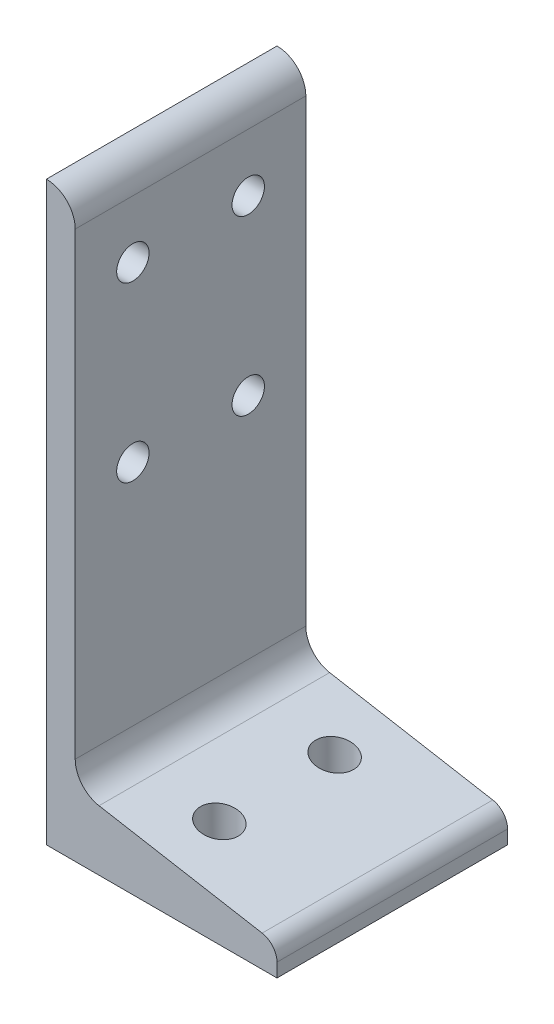
ISO-10303-21;
HEADER;
FILE_DESCRIPTION(('STEP AP214'),'2;1');
FILE_NAME('part.step','',(''),(''),'','','');
FILE_SCHEMA(('AUTOMOTIVE_DESIGN { 1 0 10303 214 1 1 1 1 }'));
ENDSEC;
DATA;
#1=APPLICATION_CONTEXT('core data for automotive mechanical design processes');
#2=APPLICATION_PROTOCOL_DEFINITION('international standard','automotive_design',2000,#1);
#3=PRODUCT_CONTEXT('',#1,'mechanical');
#4=PRODUCT('Part','Part','',(#3));
#5=PRODUCT_RELATED_PRODUCT_CATEGORY('part','',(#4));
#6=PRODUCT_DEFINITION_FORMATION('','',#4);
#7=PRODUCT_DEFINITION_CONTEXT('part definition',#1,'design');
#8=PRODUCT_DEFINITION('design','',#6,#7);
#9=PRODUCT_DEFINITION_SHAPE('','',#8);
#10=(LENGTH_UNIT() NAMED_UNIT(*) SI_UNIT(.MILLI.,.METRE.));
#11=(NAMED_UNIT(*) PLANE_ANGLE_UNIT() SI_UNIT($,.RADIAN.));
#12=(NAMED_UNIT(*) SI_UNIT($,.STERADIAN.) SOLID_ANGLE_UNIT());
#13=UNCERTAINTY_MEASURE_WITH_UNIT(LENGTH_MEASURE(1.E-05),#10,'distance_accuracy_value','');
#14=(GEOMETRIC_REPRESENTATION_CONTEXT(3) GLOBAL_UNCERTAINTY_ASSIGNED_CONTEXT((#13)) GLOBAL_UNIT_ASSIGNED_CONTEXT((#10,
#11,#12)) REPRESENTATION_CONTEXT('',''));
#15=CARTESIAN_POINT('',(0.,0.,0.));
#16=DIRECTION('',(0.,0.,1.));
#17=DIRECTION('',(1.,0.,0.));
#18=AXIS2_PLACEMENT_3D('',#15,#16,#17);
#19=CARTESIAN_POINT('',(-16.3878975119817,-59.0727168406568,50.8));
#20=DIRECTION('',(-1.,0.,0.));
#21=DIRECTION('',(0.,-1.,0.));
#22=AXIS2_PLACEMENT_3D('',#19,#20,#21);
#23=PLANE('',#22);
#24=CARTESIAN_POINT('',(-16.3878975119818,121.648995440178,12.6852380775335));
#25=DIRECTION('',(1.,0.,0.));
#26=DIRECTION('',(0.,1.,0.));
#27=AXIS2_PLACEMENT_3D('',#24,#25,#26);
#28=CIRCLE('',#27,3.56870000000001);
#29=CARTESIAN_POINT('',(-16.3878975119818,125.217695440178,12.6852380775335));
#30=VERTEX_POINT('',#29);
#31=EDGE_CURVE('E173',#30,#30,#28,.T.);
#32=ORIENTED_EDGE('',*,*,#31,.F.);
#33=EDGE_LOOP('',(#32));
#34=FACE_BOUND('',#33,.T.);
#35=CARTESIAN_POINT('',(-16.3878975119817,83.5489782815445,12.6852380775335));
#36=DIRECTION('',(1.,0.,0.));
#37=DIRECTION('',(0.,1.,0.));
#38=AXIS2_PLACEMENT_3D('',#35,#36,#37);
#39=CIRCLE('',#38,3.56869999999999);
#40=CARTESIAN_POINT('',(-16.3878975119817,87.1176782815445,12.6852380775335));
#41=VERTEX_POINT('',#40);
#42=EDGE_CURVE('E189',#41,#41,#39,.T.);
#43=ORIENTED_EDGE('',*,*,#42,.F.);
#44=EDGE_LOOP('',(#43));
#45=FACE_BOUND('',#44,.T.);
#46=CARTESIAN_POINT('',(-16.3878975119817,83.5489782815445,38.1));
#47=DIRECTION('',(1.,0.,0.));
#48=DIRECTION('',(0.,1.,0.));
#49=AXIS2_PLACEMENT_3D('',#46,#47,#48);
#50=CIRCLE('',#49,3.56869999999999);
#51=CARTESIAN_POINT('',(-16.3878975119817,87.1176782815445,38.1));
#52=VERTEX_POINT('',#51);
#53=EDGE_CURVE('E194',#52,#52,#50,.T.);
#54=ORIENTED_EDGE('',*,*,#53,.F.);
#55=EDGE_LOOP('',(#54));
#56=FACE_BOUND('',#55,.T.);
#57=CARTESIAN_POINT('',(-16.3878975119818,121.648978281545,38.1));
#58=DIRECTION('',(1.,0.,0.));
#59=DIRECTION('',(0.,1.,0.));
#60=AXIS2_PLACEMENT_3D('',#57,#58,#59);
#61=CIRCLE('',#60,3.56870000000002);
#62=CARTESIAN_POINT('',(-16.3878975119818,125.217678281545,38.1));
#63=VERTEX_POINT('',#62);
#64=EDGE_CURVE('E200',#63,#63,#61,.T.);
#65=ORIENTED_EDGE('',*,*,#64,.F.);
#66=EDGE_LOOP('',(#65));
#67=FACE_BOUND('',#66,.T.);
#68=DIRECTION('',(0.,1.,0.));
#69=VECTOR('',#68,1.);
#70=CARTESIAN_POINT('',(-16.3878975119817,-59.0727168406568,0.));
#71=LINE('',#70,#69);
#72=CARTESIAN_POINT('',(-16.3878975119817,33.2149952320115,0.));
#73=VERTEX_POINT('',#72);
#74=CARTESIAN_POINT('',(-16.3878975119818,134.348978281545,0.));
#75=VERTEX_POINT('',#74);
#76=EDGE_CURVE('E116',#73,#75,#71,.T.);
#77=ORIENTED_EDGE('',*,*,#76,.T.);
#78=DIRECTION('',(0.,0.,-1.));
#79=VECTOR('',#78,1.);
#80=CARTESIAN_POINT('',(-16.3878975119818,134.348978281545,50.8));
#81=LINE('',#80,#79);
#82=CARTESIAN_POINT('',(-16.3878975119818,134.348978281545,50.8));
#83=VERTEX_POINT('',#82);
#84=EDGE_CURVE('E10',#83,#75,#81,.T.);
#85=ORIENTED_EDGE('',*,*,#84,.F.);
#86=DIRECTION('',(0.,1.,0.));
#87=VECTOR('',#86,1.);
#88=CARTESIAN_POINT('',(-16.3878975119817,-59.0727168406568,50.8));
#89=LINE('',#88,#87);
#90=CARTESIAN_POINT('',(-16.3878975119817,33.2149952320115,50.8));
#91=VERTEX_POINT('',#90);
#92=EDGE_CURVE('E148',#91,#83,#89,.T.);
#93=ORIENTED_EDGE('',*,*,#92,.F.);
#94=DIRECTION('',(0.,0.,-1.));
#95=VECTOR('',#94,1.);
#96=CARTESIAN_POINT('',(-16.3878975119817,33.2149952320115,50.8));
#97=LINE('',#96,#95);
#98=EDGE_CURVE('E33',#91,#73,#97,.T.);
#99=ORIENTED_EDGE('',*,*,#98,.T.);
#100=EDGE_LOOP('',(#77,#85,#93,#99));
#101=FACE_BOUND('',#100,.T.);
#102=ADVANCED_FACE('F15',(#34,#45,#56,#67,#101),#23,.F.);
#103=CARTESIAN_POINT('',(-22.7378975119818,134.348978281545,50.8));
#104=DIRECTION('',(0.,0.,1.));
#105=DIRECTION('',(-1.,0.,0.));
#106=AXIS2_PLACEMENT_3D('',#103,#104,#105);
#107=ELLIPSE('',#106,6.35,6.34999999999999);
#108=DIRECTION('',(0.,0.,-1.));
#109=VECTOR('',#108,1.);
#110=SURFACE_OF_LINEAR_EXTRUSION('',#107,#109);
#111=CARTESIAN_POINT('',(-22.7378975119818,134.348978281545,0.));
#112=DIRECTION('',(0.,0.,1.));
#113=DIRECTION('',(-1.,0.,0.));
#114=AXIS2_PLACEMENT_3D('',#111,#112,#113);
#115=ELLIPSE('',#114,6.35,6.34999999999999);
#116=CARTESIAN_POINT('',(-22.7378975119817,140.698978281545,0.));
#117=VERTEX_POINT('',#116);
#118=EDGE_CURVE('E215',#75,#117,#115,.T.);
#119=ORIENTED_EDGE('',*,*,#118,.T.);
#120=DIRECTION('',(0.,0.,-1.));
#121=VECTOR('',#120,1.);
#122=CARTESIAN_POINT('',(-22.7378975119817,140.698978281545,50.8));
#123=LINE('',#122,#121);
#124=CARTESIAN_POINT('',(-22.7378975119817,140.698978281545,50.8));
#125=VERTEX_POINT('',#124);
#126=EDGE_CURVE('E24',#125,#117,#123,.T.);
#127=ORIENTED_EDGE('',*,*,#126,.F.);
#128=EDGE_CURVE('E72',#83,#125,#107,.T.);
#129=ORIENTED_EDGE('',*,*,#128,.F.);
#130=ORIENTED_EDGE('',*,*,#84,.T.);
#131=EDGE_LOOP('',(#119,#127,#129,#130));
#132=FACE_BOUND('',#131,.T.);
#133=ADVANCED_FACE('F140',(#132),#110,.F.);
#134=CARTESIAN_POINT('',(-22.7378975119817,-59.0727168406568,50.8));
#135=DIRECTION('',(1.,0.,0.));
#136=DIRECTION('',(0.,1.,0.));
#137=AXIS2_PLACEMENT_3D('',#134,#135,#136);
#138=PLANE('',#137);
#139=CARTESIAN_POINT('',(-22.7378975119818,121.648995440178,12.6852380775335));
#140=DIRECTION('',(1.,0.,0.));
#141=DIRECTION('',(0.,1.,0.));
#142=AXIS2_PLACEMENT_3D('',#139,#140,#141);
#143=CIRCLE('',#142,3.56870000000001);
#144=CARTESIAN_POINT('',(-22.7378975119818,125.217695440178,12.6852380775335));
#145=VERTEX_POINT('',#144);
#146=EDGE_CURVE('E178',#145,#145,#143,.T.);
#147=ORIENTED_EDGE('',*,*,#146,.T.);
#148=EDGE_LOOP('',(#147));
#149=FACE_BOUND('',#148,.T.);
#150=CARTESIAN_POINT('',(-22.7378975119818,83.5489782815445,12.6852380775335));
#151=DIRECTION('',(1.,0.,0.));
#152=DIRECTION('',(0.,1.,0.));
#153=AXIS2_PLACEMENT_3D('',#150,#151,#152);
#154=CIRCLE('',#153,3.56869999999999);
#155=CARTESIAN_POINT('',(-22.7378975119818,87.1176782815445,12.6852380775335));
#156=VERTEX_POINT('',#155);
#157=EDGE_CURVE('E191',#156,#156,#154,.T.);
#158=ORIENTED_EDGE('',*,*,#157,.T.);
#159=EDGE_LOOP('',(#158));
#160=FACE_BOUND('',#159,.T.);
#161=CARTESIAN_POINT('',(-22.7378975119818,83.5489782815445,38.1));
#162=DIRECTION('',(1.,0.,0.));
#163=DIRECTION('',(0.,1.,0.));
#164=AXIS2_PLACEMENT_3D('',#161,#162,#163);
#165=CIRCLE('',#164,3.56869999999999);
#166=CARTESIAN_POINT('',(-22.7378975119818,87.1176782815445,38.1));
#167=VERTEX_POINT('',#166);
#168=EDGE_CURVE('E197',#167,#167,#165,.T.);
#169=ORIENTED_EDGE('',*,*,#168,.T.);
#170=EDGE_LOOP('',(#169));
#171=FACE_BOUND('',#170,.T.);
#172=CARTESIAN_POINT('',(-22.7378975119818,121.648978281545,38.1));
#173=DIRECTION('',(1.,0.,0.));
#174=DIRECTION('',(0.,1.,0.));
#175=AXIS2_PLACEMENT_3D('',#172,#173,#174);
#176=CIRCLE('',#175,3.56870000000002);
#177=CARTESIAN_POINT('',(-22.7378975119818,125.217678281545,38.1));
#178=VERTEX_POINT('',#177);
#179=EDGE_CURVE('E203',#178,#178,#176,.T.);
#180=ORIENTED_EDGE('',*,*,#179,.T.);
#181=EDGE_LOOP('',(#180));
#182=FACE_BOUND('',#181,.T.);
#183=DIRECTION('',(0.,-1.,0.));
#184=VECTOR('',#183,1.);
#185=CARTESIAN_POINT('',(-22.7378975119817,-59.0727168406568,0.));
#186=LINE('',#185,#184);
#187=CARTESIAN_POINT('',(-22.7378975119817,13.6989782815445,0.));
#188=VERTEX_POINT('',#187);
#189=EDGE_CURVE('E216',#117,#188,#186,.T.);
#190=ORIENTED_EDGE('',*,*,#189,.T.);
#191=DIRECTION('',(0.,0.,-1.));
#192=VECTOR('',#191,1.);
#193=CARTESIAN_POINT('',(-22.7378975119817,13.6989782815445,50.8));
#194=LINE('',#193,#192);
#195=CARTESIAN_POINT('',(-22.7378975119817,13.6989782815445,50.8));
#196=VERTEX_POINT('',#195);
#197=EDGE_CURVE('E163',#196,#188,#194,.T.);
#198=ORIENTED_EDGE('',*,*,#197,.F.);
#199=DIRECTION('',(0.,-1.,0.));
#200=VECTOR('',#199,1.);
#201=CARTESIAN_POINT('',(-22.7378975119817,-59.0727168406568,50.8));
#202=LINE('',#201,#200);
#203=EDGE_CURVE('E147',#125,#196,#202,.T.);
#204=ORIENTED_EDGE('',*,*,#203,.F.);
#205=ORIENTED_EDGE('',*,*,#126,.T.);
#206=EDGE_LOOP('',(#190,#198,#204,#205));
#207=FACE_BOUND('',#206,.T.);
#208=ADVANCED_FACE('F137',(#149,#160,#171,#182,#207),#138,.F.);
#209=CARTESIAN_POINT('',(-12.9149361595296,13.6989782815445,50.8));
#210=DIRECTION('',(0.,1.,0.));
#211=DIRECTION('',(-1.,0.,0.));
#212=AXIS2_PLACEMENT_3D('',#209,#210,#211);
#213=PLANE('',#212);
#214=CARTESIAN_POINT('',(2.66210248801829,13.6989782815445,38.1));
#215=DIRECTION('',(0.,-1.,0.));
#216=DIRECTION('',(1.,0.,0.));
#217=AXIS2_PLACEMENT_3D('',#214,#215,#216);
#218=CIRCLE('',#217,4.1656);
#219=CARTESIAN_POINT('',(6.82770248801829,13.6989782815445,38.1));
#220=VERTEX_POINT('',#219);
#221=EDGE_CURVE('E185',#220,#220,#218,.T.);
#222=ORIENTED_EDGE('',*,*,#221,.F.);
#223=EDGE_LOOP('',(#222));
#224=FACE_BOUND('',#223,.T.);
#225=CARTESIAN_POINT('',(2.66210248801829,13.6989782815445,12.7));
#226=DIRECTION('',(0.,-1.,0.));
#227=DIRECTION('',(1.,0.,0.));
#228=AXIS2_PLACEMENT_3D('',#225,#226,#227);
#229=CIRCLE('',#228,4.1656);
#230=CARTESIAN_POINT('',(6.82770248801829,13.6989782815445,12.7));
#231=VERTEX_POINT('',#230);
#232=EDGE_CURVE('E174',#231,#231,#229,.T.);
#233=ORIENTED_EDGE('',*,*,#232,.F.);
#234=EDGE_LOOP('',(#233));
#235=FACE_BOUND('',#234,.T.);
#236=DIRECTION('',(1.,0.,0.));
#237=VECTOR('',#236,1.);
#238=CARTESIAN_POINT('',(-12.9149361595296,13.6989782815445,0.));
#239=LINE('',#238,#237);
#240=CARTESIAN_POINT('',(28.0621024880183,13.6989782815445,0.));
#241=VERTEX_POINT('',#240);
#242=EDGE_CURVE('E161',#188,#241,#239,.T.);
#243=ORIENTED_EDGE('',*,*,#242,.T.);
#244=DIRECTION('',(0.,0.,-1.));
#245=VECTOR('',#244,1.);
#246=CARTESIAN_POINT('',(28.0621024880183,13.6989782815445,50.8));
#247=LINE('',#246,#245);
#248=CARTESIAN_POINT('',(28.0621024880183,13.6989782815445,50.8));
#249=VERTEX_POINT('',#248);
#250=EDGE_CURVE('E159',#249,#241,#247,.T.);
#251=ORIENTED_EDGE('',*,*,#250,.F.);
#252=DIRECTION('',(1.,0.,0.));
#253=VECTOR('',#252,1.);
#254=CARTESIAN_POINT('',(-12.9149361595296,13.6989782815445,50.8));
#255=LINE('',#254,#253);
#256=EDGE_CURVE('E151',#196,#249,#255,.T.);
#257=ORIENTED_EDGE('',*,*,#256,.F.);
#258=ORIENTED_EDGE('',*,*,#197,.T.);
#259=EDGE_LOOP('',(#243,#251,#257,#258));
#260=FACE_BOUND('',#259,.T.);
#261=ADVANCED_FACE('F133',(#224,#235,#260),#213,.F.);
#262=CARTESIAN_POINT('',(28.0621024880184,-59.0727168406568,50.8));
#263=DIRECTION('',(-1.,0.,0.));
#264=DIRECTION('',(0.,-1.,0.));
#265=AXIS2_PLACEMENT_3D('',#262,#263,#264);
#266=PLANE('',#265);
#267=DIRECTION('',(0.,1.,0.));
#268=VECTOR('',#267,1.);
#269=CARTESIAN_POINT('',(28.0621024880184,-59.0727168406568,0.));
#270=LINE('',#269,#268);
#271=CARTESIAN_POINT('',(28.0621024880183,16.7241299029677,0.));
#272=VERTEX_POINT('',#271);
#273=EDGE_CURVE('E165',#241,#272,#270,.T.);
#274=ORIENTED_EDGE('',*,*,#273,.T.);
#275=DIRECTION('',(0.,0.,-1.));
#276=VECTOR('',#275,1.);
#277=CARTESIAN_POINT('',(28.0621024880183,16.7241299029677,50.8));
#278=LINE('',#277,#276);
#279=CARTESIAN_POINT('',(28.0621024880183,16.7241299029677,50.8));
#280=VERTEX_POINT('',#279);
#281=EDGE_CURVE('E106',#280,#272,#278,.T.);
#282=ORIENTED_EDGE('',*,*,#281,.F.);
#283=DIRECTION('',(0.,1.,0.));
#284=VECTOR('',#283,1.);
#285=CARTESIAN_POINT('',(28.0621024880184,-59.0727168406568,50.8));
#286=LINE('',#285,#284);
#287=EDGE_CURVE('E94',#249,#280,#286,.T.);
#288=ORIENTED_EDGE('',*,*,#287,.F.);
#289=ORIENTED_EDGE('',*,*,#250,.T.);
#290=EDGE_LOOP('',(#274,#282,#288,#289));
#291=FACE_BOUND('',#290,.T.);
#292=ADVANCED_FACE('F130',(#291),#266,.F.);
#293=CARTESIAN_POINT('',(24.0997024880183,16.7241299029677,50.8));
#294=DIRECTION('',(0.,0.,1.));
#295=DIRECTION('',(1.,0.,0.));
#296=AXIS2_PLACEMENT_3D('',#293,#294,#295);
#297=ELLIPSE('',#296,3.9624,3.9624);
#298=DIRECTION('',(0.,0.,-1.));
#299=VECTOR('',#298,1.);
#300=SURFACE_OF_LINEAR_EXTRUSION('',#297,#299);
#301=CARTESIAN_POINT('',(24.0997024880183,16.7241299029677,0.));
#302=DIRECTION('',(0.,0.,1.));
#303=DIRECTION('',(1.,0.,0.));
#304=AXIS2_PLACEMENT_3D('',#301,#302,#303);
#305=ELLIPSE('',#304,3.9624,3.9624);
#306=CARTESIAN_POINT('',(24.7877660272057,20.6263321435033,0.));
#307=VERTEX_POINT('',#306);
#308=EDGE_CURVE('E103',#272,#307,#305,.T.);
#309=ORIENTED_EDGE('',*,*,#308,.T.);
#310=DIRECTION('',(0.,0.,-1.));
#311=VECTOR('',#310,1.);
#312=CARTESIAN_POINT('',(24.7877660272057,20.6263321435033,50.8));
#313=LINE('',#312,#311);
#314=CARTESIAN_POINT('',(24.7877660272057,20.6263321435033,50.8));
#315=VERTEX_POINT('',#314);
#316=EDGE_CURVE('E100',#315,#307,#313,.T.);
#317=ORIENTED_EDGE('',*,*,#316,.F.);
#318=EDGE_CURVE('E87',#280,#315,#297,.T.);
#319=ORIENTED_EDGE('',*,*,#318,.F.);
#320=ORIENTED_EDGE('',*,*,#281,.T.);
#321=EDGE_LOOP('',(#309,#317,#319,#320));
#322=FACE_BOUND('',#321,.T.);
#323=ADVANCED_FACE('F101',(#322),#300,.F.);
#324=CARTESIAN_POINT('',(1.85127949779703,24.6706535612943,50.8));
#325=DIRECTION('',(-0.17364817766693,-0.984807753012208,0.));
#326=DIRECTION('',(0.984807753012208,-0.17364817766693,0.));
#327=AXIS2_PLACEMENT_3D('',#324,#325,#326);
#328=PLANE('',#327);
#329=CARTESIAN_POINT('',(2.66210248801829,24.5276835915395,38.1));
#330=DIRECTION('',(-0.17364817766693,-0.984807753012208,0.));
#331=DIRECTION('',(0.984807753012208,-0.17364817766693,0.));
#332=AXIS2_PLACEMENT_3D('',#329,#330,#331);
#333=ELLIPSE('',#332,4.22986109447126,4.1656);
#334=CARTESIAN_POINT('',(6.82770248801829,23.7931759207004,38.1));
#335=VERTEX_POINT('',#334);
#336=EDGE_CURVE('E18',#335,#335,#333,.T.);
#337=ORIENTED_EDGE('',*,*,#336,.T.);
#338=EDGE_LOOP('',(#337));
#339=FACE_BOUND('',#338,.T.);
#340=CARTESIAN_POINT('',(2.66210248801829,24.5276835915395,12.7));
#341=DIRECTION('',(-0.17364817766693,-0.984807753012208,0.));
#342=DIRECTION('',(0.984807753012208,-0.17364817766693,0.));
#343=AXIS2_PLACEMENT_3D('',#340,#341,#342);
#344=ELLIPSE('',#343,4.22986109447126,4.1656);
#345=CARTESIAN_POINT('',(6.82770248801829,23.7931759207004,12.7));
#346=VERTEX_POINT('',#345);
#347=EDGE_CURVE('E171',#346,#346,#344,.T.);
#348=ORIENTED_EDGE('',*,*,#347,.T.);
#349=EDGE_LOOP('',(#348));
#350=FACE_BOUND('',#349,.T.);
#351=DIRECTION('',(-0.984807753012208,0.17364817766693,0.));
#352=VECTOR('',#351,1.);
#353=CARTESIAN_POINT('',(1.85127949779703,24.6706535612943,0.));
#354=LINE('',#353,#352);
#355=CARTESIAN_POINT('',(-11.1405634401667,26.961466000384,0.));
#356=VERTEX_POINT('',#355);
#357=EDGE_CURVE('E222',#307,#356,#354,.T.);
#358=ORIENTED_EDGE('',*,*,#357,.T.);
#359=DIRECTION('',(0.,0.,-1.));
#360=VECTOR('',#359,1.);
#361=CARTESIAN_POINT('',(-11.1405634401667,26.961466000384,50.8));
#362=LINE('',#361,#360);
#363=CARTESIAN_POINT('',(-11.1405634401667,26.961466000384,50.8));
#364=VERTEX_POINT('',#363);
#365=EDGE_CURVE('E60',#364,#356,#362,.T.);
#366=ORIENTED_EDGE('',*,*,#365,.F.);
#367=DIRECTION('',(-0.984807753012208,0.17364817766693,0.));
#368=VECTOR('',#367,1.);
#369=CARTESIAN_POINT('',(1.85127949779703,24.6706535612943,50.8));
#370=LINE('',#369,#368);
#371=EDGE_CURVE('E92',#315,#364,#370,.T.);
#372=ORIENTED_EDGE('',*,*,#371,.F.);
#373=ORIENTED_EDGE('',*,*,#316,.T.);
#374=EDGE_LOOP('',(#358,#366,#372,#373));
#375=FACE_BOUND('',#374,.T.);
#376=ADVANCED_FACE('F108',(#339,#350,#375),#328,.F.);
#377=CARTESIAN_POINT('',(-10.0378975119817,33.2149952320115,50.8));
#378=DIRECTION('',(0.,0.,1.));
#379=DIRECTION('',(0.,1.,0.));
#380=AXIS2_PLACEMENT_3D('',#377,#378,#379);
#381=ELLIPSE('',#380,6.35,6.35);
#382=DIRECTION('',(0.,0.,-1.));
#383=VECTOR('',#382,1.);
#384=SURFACE_OF_LINEAR_EXTRUSION('',#381,#383);
#385=CARTESIAN_POINT('',(-10.0378975119817,33.2149952320115,0.));
#386=DIRECTION('',(0.,0.,1.));
#387=DIRECTION('',(0.,1.,0.));
#388=AXIS2_PLACEMENT_3D('',#385,#386,#387);
#389=ELLIPSE('',#388,6.35,6.35);
#390=EDGE_CURVE('E224',#73,#356,#389,.T.);
#391=ORIENTED_EDGE('',*,*,#390,.F.);
#392=ORIENTED_EDGE('',*,*,#98,.F.);
#393=EDGE_CURVE('E109',#91,#364,#381,.T.);
#394=ORIENTED_EDGE('',*,*,#393,.T.);
#395=ORIENTED_EDGE('',*,*,#365,.T.);
#396=EDGE_LOOP('',(#391,#392,#394,#395));
#397=FACE_BOUND('',#396,.T.);
#398=ADVANCED_FACE('F119',(#397),#384,.T.);
#399=CARTESIAN_POINT('',(-12.9149361595296,-59.0727168406568,50.8));
#400=DIRECTION('',(0.,0.,1.));
#401=DIRECTION('',(1.,0.,0.));
#402=AXIS2_PLACEMENT_3D('',#399,#400,#401);
#403=PLANE('',#402);
#404=ORIENTED_EDGE('',*,*,#92,.T.);
#405=ORIENTED_EDGE('',*,*,#128,.T.);
#406=ORIENTED_EDGE('',*,*,#203,.T.);
#407=ORIENTED_EDGE('',*,*,#256,.T.);
#408=ORIENTED_EDGE('',*,*,#287,.T.);
#409=ORIENTED_EDGE('',*,*,#318,.T.);
#410=ORIENTED_EDGE('',*,*,#371,.T.);
#411=ORIENTED_EDGE('',*,*,#393,.F.);
#412=EDGE_LOOP('',(#404,#405,#406,#407,#408,#409,#410,#411));
#413=FACE_BOUND('',#412,.T.);
#414=ADVANCED_FACE('F89',(#413),#403,.T.);
#415=CARTESIAN_POINT('',(-12.9149361595296,-59.0727168406568,0.));
#416=DIRECTION('',(0.,0.,1.));
#417=DIRECTION('',(1.,0.,0.));
#418=AXIS2_PLACEMENT_3D('',#415,#416,#417);
#419=PLANE('',#418);
#420=ORIENTED_EDGE('',*,*,#76,.F.);
#421=ORIENTED_EDGE('',*,*,#390,.T.);
#422=ORIENTED_EDGE('',*,*,#357,.F.);
#423=ORIENTED_EDGE('',*,*,#308,.F.);
#424=ORIENTED_EDGE('',*,*,#273,.F.);
#425=ORIENTED_EDGE('',*,*,#242,.F.);
#426=ORIENTED_EDGE('',*,*,#189,.F.);
#427=ORIENTED_EDGE('',*,*,#118,.F.);
#428=EDGE_LOOP('',(#420,#421,#422,#423,#424,#425,#426,#427));
#429=FACE_BOUND('',#428,.T.);
#430=ADVANCED_FACE('F123',(#429),#419,.F.);
#431=CARTESIAN_POINT('',(-22.7378975119818,121.648978281545,38.1));
#432=DIRECTION('',(1.,0.,0.));
#433=DIRECTION('',(0.,1.,0.));
#434=AXIS2_PLACEMENT_3D('',#431,#432,#433);
#435=CYLINDRICAL_SURFACE('',#434,3.56870000000002);
#436=ORIENTED_EDGE('',*,*,#179,.F.);
#437=EDGE_LOOP('',(#436));
#438=FACE_BOUND('',#437,.T.);
#439=ORIENTED_EDGE('',*,*,#64,.T.);
#440=EDGE_LOOP('',(#439));
#441=FACE_BOUND('',#440,.T.);
#442=ADVANCED_FACE('F208',(#438,#441),#435,.F.);
#443=CARTESIAN_POINT('',(-22.7378975119818,83.5489782815445,38.1));
#444=DIRECTION('',(1.,0.,0.));
#445=DIRECTION('',(0.,1.,0.));
#446=AXIS2_PLACEMENT_3D('',#443,#444,#445);
#447=CYLINDRICAL_SURFACE('',#446,3.56869999999999);
#448=ORIENTED_EDGE('',*,*,#168,.F.);
#449=EDGE_LOOP('',(#448));
#450=FACE_BOUND('',#449,.T.);
#451=ORIENTED_EDGE('',*,*,#53,.T.);
#452=EDGE_LOOP('',(#451));
#453=FACE_BOUND('',#452,.T.);
#454=ADVANCED_FACE('F235',(#450,#453),#447,.F.);
#455=CARTESIAN_POINT('',(-22.7378975119818,83.5489782815445,12.6852380775335));
#456=DIRECTION('',(1.,0.,0.));
#457=DIRECTION('',(0.,1.,0.));
#458=AXIS2_PLACEMENT_3D('',#455,#456,#457);
#459=CYLINDRICAL_SURFACE('',#458,3.56869999999999);
#460=ORIENTED_EDGE('',*,*,#157,.F.);
#461=EDGE_LOOP('',(#460));
#462=FACE_BOUND('',#461,.T.);
#463=ORIENTED_EDGE('',*,*,#42,.T.);
#464=EDGE_LOOP('',(#463));
#465=FACE_BOUND('',#464,.T.);
#466=ADVANCED_FACE('F244',(#462,#465),#459,.F.);
#467=CARTESIAN_POINT('',(-22.7378975119818,121.648995440178,12.6852380775335));
#468=DIRECTION('',(1.,0.,0.));
#469=DIRECTION('',(0.,1.,0.));
#470=AXIS2_PLACEMENT_3D('',#467,#468,#469);
#471=CYLINDRICAL_SURFACE('',#470,3.56870000000001);
#472=ORIENTED_EDGE('',*,*,#146,.F.);
#473=EDGE_LOOP('',(#472));
#474=FACE_BOUND('',#473,.T.);
#475=ORIENTED_EDGE('',*,*,#31,.T.);
#476=EDGE_LOOP('',(#475));
#477=FACE_BOUND('',#476,.T.);
#478=ADVANCED_FACE('F248',(#474,#477),#471,.F.);
#479=CARTESIAN_POINT('',(2.66210248801824,140.698978281545,12.7));
#480=DIRECTION('',(0.,-1.,0.));
#481=DIRECTION('',(1.,0.,0.));
#482=AXIS2_PLACEMENT_3D('',#479,#480,#481);
#483=CYLINDRICAL_SURFACE('',#482,4.1656);
#484=ORIENTED_EDGE('',*,*,#232,.T.);
#485=EDGE_LOOP('',(#484));
#486=FACE_BOUND('',#485,.T.);
#487=ORIENTED_EDGE('',*,*,#347,.F.);
#488=EDGE_LOOP('',(#487));
#489=FACE_BOUND('',#488,.T.);
#490=ADVANCED_FACE('F252',(#486,#489),#483,.F.);
#491=CARTESIAN_POINT('',(2.66210248801824,140.698978281545,38.1));
#492=DIRECTION('',(0.,-1.,0.));
#493=DIRECTION('',(1.,0.,0.));
#494=AXIS2_PLACEMENT_3D('',#491,#492,#493);
#495=CYLINDRICAL_SURFACE('',#494,4.1656);
#496=ORIENTED_EDGE('',*,*,#221,.T.);
#497=EDGE_LOOP('',(#496));
#498=FACE_BOUND('',#497,.T.);
#499=ORIENTED_EDGE('',*,*,#336,.F.);
#500=EDGE_LOOP('',(#499));
#501=FACE_BOUND('',#500,.T.);
#502=ADVANCED_FACE('F256',(#498,#501),#495,.F.);
#503=CLOSED_SHELL('',(#102,#133,#208,#261,#292,#323,#376,#398,#414,#430,#442,#454,#466,#478,
#490,#502));
#504=MANIFOLD_SOLID_BREP('B1',#503);
#505=ADVANCED_BREP_SHAPE_REPRESENTATION('',(#18,#504),#14);
#506=SHAPE_DEFINITION_REPRESENTATION(#9,#505);
ENDSEC;
END-ISO-10303-21;
